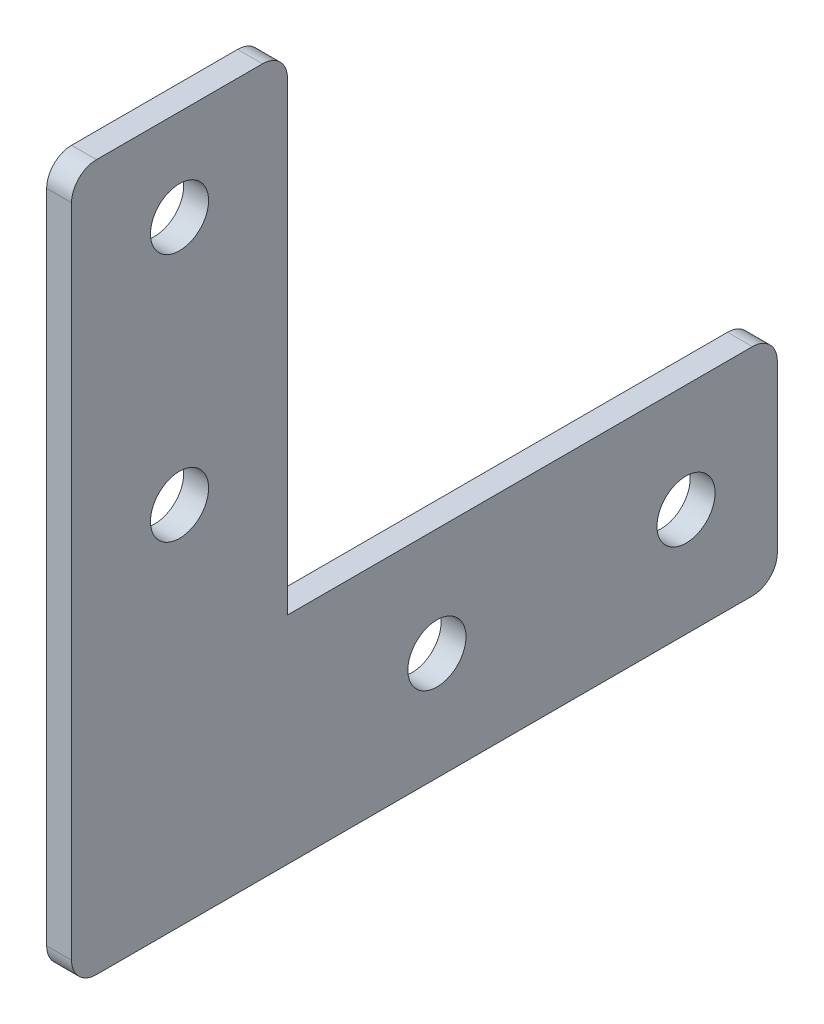
ISO-10303-21;
HEADER;
FILE_DESCRIPTION(('STEP AP214'),'2;1');
FILE_NAME('part.step','',(''),(''),'','','');
FILE_SCHEMA(('AUTOMOTIVE_DESIGN { 1 0 10303 214 1 1 1 1 }'));
ENDSEC;
DATA;
#1=APPLICATION_CONTEXT('core data for automotive mechanical design processes');
#2=APPLICATION_PROTOCOL_DEFINITION('international standard','automotive_design',2000,#1);
#3=PRODUCT_CONTEXT('',#1,'mechanical');
#4=PRODUCT('Part','Part','',(#3));
#5=PRODUCT_RELATED_PRODUCT_CATEGORY('part','',(#4));
#6=PRODUCT_DEFINITION_FORMATION('','',#4);
#7=PRODUCT_DEFINITION_CONTEXT('part definition',#1,'design');
#8=PRODUCT_DEFINITION('design','',#6,#7);
#9=PRODUCT_DEFINITION_SHAPE('','',#8);
#10=(LENGTH_UNIT() NAMED_UNIT(*) SI_UNIT(.MILLI.,.METRE.));
#11=(NAMED_UNIT(*) PLANE_ANGLE_UNIT() SI_UNIT($,.RADIAN.));
#12=(NAMED_UNIT(*) SI_UNIT($,.STERADIAN.) SOLID_ANGLE_UNIT());
#13=UNCERTAINTY_MEASURE_WITH_UNIT(LENGTH_MEASURE(1.E-05),#10,'distance_accuracy_value','');
#14=(GEOMETRIC_REPRESENTATION_CONTEXT(3) GLOBAL_UNCERTAINTY_ASSIGNED_CONTEXT((#13)) GLOBAL_UNIT_ASSIGNED_CONTEXT((#10,
#11,#12)) REPRESENTATION_CONTEXT('',''));
#15=CARTESIAN_POINT('',(0.,0.,0.));
#16=DIRECTION('',(0.,0.,1.));
#17=DIRECTION('',(1.,0.,0.));
#18=AXIS2_PLACEMENT_3D('',#15,#16,#17);
#19=CARTESIAN_POINT('',(3.,0.,-85.));
#20=DIRECTION('',(0.,0.,1.));
#21=DIRECTION('',(0.,-1.,0.));
#22=AXIS2_PLACEMENT_3D('',#19,#20,#21);
#23=PLANE('',#22);
#24=DIRECTION('',(0.,1.,0.));
#25=VECTOR('',#24,1.);
#26=CARTESIAN_POINT('',(0.,0.,-85.));
#27=LINE('',#26,#25);
#28=CARTESIAN_POINT('',(0.,3.,-85.));
#29=VERTEX_POINT('',#28);
#30=CARTESIAN_POINT('',(0.,23.,-85.));
#31=VERTEX_POINT('',#30);
#32=EDGE_CURVE('E136',#29,#31,#27,.T.);
#33=ORIENTED_EDGE('',*,*,#32,.T.);
#34=DIRECTION('',(-1.,0.,0.));
#35=VECTOR('',#34,1.);
#36=CARTESIAN_POINT('',(3.,23.,-85.));
#37=LINE('',#36,#35);
#38=CARTESIAN_POINT('',(3.,23.,-85.));
#39=VERTEX_POINT('',#38);
#40=EDGE_CURVE('E183',#31,#39,#37,.F.);
#41=ORIENTED_EDGE('',*,*,#40,.T.);
#42=DIRECTION('',(0.,1.,0.));
#43=VECTOR('',#42,1.);
#44=CARTESIAN_POINT('',(3.,0.,-85.));
#45=LINE('',#44,#43);
#46=CARTESIAN_POINT('',(3.,3.,-85.));
#47=VERTEX_POINT('',#46);
#48=EDGE_CURVE('E149',#47,#39,#45,.T.);
#49=ORIENTED_EDGE('',*,*,#48,.F.);
#50=DIRECTION('',(-1.,0.,0.));
#51=VECTOR('',#50,1.);
#52=CARTESIAN_POINT('',(3.,3.,-85.));
#53=LINE('',#52,#51);
#54=EDGE_CURVE('E180',#47,#29,#53,.T.);
#55=ORIENTED_EDGE('',*,*,#54,.T.);
#56=EDGE_LOOP('',(#33,#41,#49,#55));
#57=FACE_BOUND('',#56,.T.);
#58=ADVANCED_FACE('F34',(#57),#23,.F.);
#59=CARTESIAN_POINT('',(3.,85.,0.));
#60=DIRECTION('',(0.,-1.,0.));
#61=DIRECTION('',(0.,0.,-1.));
#62=AXIS2_PLACEMENT_3D('',#59,#60,#61);
#63=PLANE('',#62);
#64=DIRECTION('',(0.,0.,1.));
#65=VECTOR('',#64,1.);
#66=CARTESIAN_POINT('',(3.,85.,0.));
#67=LINE('',#66,#65);
#68=CARTESIAN_POINT('',(3.,85.,-23.));
#69=VERTEX_POINT('',#68);
#70=CARTESIAN_POINT('',(3.,85.,-3.));
#71=VERTEX_POINT('',#70);
#72=EDGE_CURVE('E151',#69,#71,#67,.T.);
#73=ORIENTED_EDGE('',*,*,#72,.F.);
#74=DIRECTION('',(-1.,0.,0.));
#75=VECTOR('',#74,1.);
#76=CARTESIAN_POINT('',(0.,85.,-23.));
#77=LINE('',#76,#75);
#78=CARTESIAN_POINT('',(0.,85.,-23.));
#79=VERTEX_POINT('',#78);
#80=EDGE_CURVE('E42',#69,#79,#77,.T.);
#81=ORIENTED_EDGE('',*,*,#80,.T.);
#82=DIRECTION('',(0.,0.,1.));
#83=VECTOR('',#82,1.);
#84=CARTESIAN_POINT('',(0.,85.,0.));
#85=LINE('',#84,#83);
#86=CARTESIAN_POINT('',(0.,85.,-3.));
#87=VERTEX_POINT('',#86);
#88=EDGE_CURVE('E162',#79,#87,#85,.T.);
#89=ORIENTED_EDGE('',*,*,#88,.T.);
#90=DIRECTION('',(-1.,0.,0.));
#91=VECTOR('',#90,1.);
#92=CARTESIAN_POINT('',(3.,85.,-3.));
#93=LINE('',#92,#91);
#94=EDGE_CURVE('E202',#87,#71,#93,.F.);
#95=ORIENTED_EDGE('',*,*,#94,.T.);
#96=EDGE_LOOP('',(#73,#81,#89,#95));
#97=FACE_BOUND('',#96,.T.);
#98=ADVANCED_FACE('F208',(#97),#63,.F.);
#99=CARTESIAN_POINT('',(3.,0.,0.));
#100=DIRECTION('',(-1.,0.,0.));
#101=DIRECTION('',(0.,0.,1.));
#102=AXIS2_PLACEMENT_3D('',#99,#100,#101);
#103=PLANE('',#102);
#104=CARTESIAN_POINT('',(3.,74.,-13.));
#105=DIRECTION('',(1.,0.,0.));
#106=DIRECTION('',(0.,0.,-1.));
#107=AXIS2_PLACEMENT_3D('',#104,#105,#106);
#108=CIRCLE('',#107,3.5);
#109=CARTESIAN_POINT('',(3.,74.,-16.5));
#110=VERTEX_POINT('',#109);
#111=EDGE_CURVE('E408',#110,#110,#108,.T.);
#112=ORIENTED_EDGE('',*,*,#111,.F.);
#113=EDGE_LOOP('',(#112));
#114=FACE_BOUND('',#113,.T.);
#115=CARTESIAN_POINT('',(3.,44.,-13.));
#116=DIRECTION('',(1.,0.,0.));
#117=DIRECTION('',(0.,0.,-1.));
#118=AXIS2_PLACEMENT_3D('',#115,#116,#117);
#119=CIRCLE('',#118,3.5);
#120=CARTESIAN_POINT('',(3.,44.,-16.5));
#121=VERTEX_POINT('',#120);
#122=EDGE_CURVE('E404',#121,#121,#119,.T.);
#123=ORIENTED_EDGE('',*,*,#122,.F.);
#124=EDGE_LOOP('',(#123));
#125=FACE_BOUND('',#124,.T.);
#126=CARTESIAN_POINT('',(3.,13.,-74.));
#127=DIRECTION('',(1.,0.,0.));
#128=DIRECTION('',(0.,0.,-1.));
#129=AXIS2_PLACEMENT_3D('',#126,#127,#128);
#130=CIRCLE('',#129,3.5);
#131=CARTESIAN_POINT('',(3.,13.,-77.5));
#132=VERTEX_POINT('',#131);
#133=EDGE_CURVE('E400',#132,#132,#130,.T.);
#134=ORIENTED_EDGE('',*,*,#133,.F.);
#135=EDGE_LOOP('',(#134));
#136=FACE_BOUND('',#135,.T.);
#137=CARTESIAN_POINT('',(3.,13.,-44.));
#138=DIRECTION('',(1.,0.,0.));
#139=DIRECTION('',(0.,0.,-1.));
#140=AXIS2_PLACEMENT_3D('',#137,#138,#139);
#141=CIRCLE('',#140,3.5);
#142=CARTESIAN_POINT('',(3.,13.,-47.5));
#143=VERTEX_POINT('',#142);
#144=EDGE_CURVE('E395',#143,#143,#141,.T.);
#145=ORIENTED_EDGE('',*,*,#144,.F.);
#146=EDGE_LOOP('',(#145));
#147=FACE_BOUND('',#146,.T.);
#148=ORIENTED_EDGE('',*,*,#48,.T.);
#149=CARTESIAN_POINT('',(3.,23.,-82.));
#150=DIRECTION('',(-1.,0.,0.));
#151=DIRECTION('',(0.,0.,1.));
#152=AXIS2_PLACEMENT_3D('',#149,#150,#151);
#153=CIRCLE('',#152,3.);
#154=CARTESIAN_POINT('',(3.,26.,-82.));
#155=VERTEX_POINT('',#154);
#156=EDGE_CURVE('E141',#39,#155,#153,.F.);
#157=ORIENTED_EDGE('',*,*,#156,.T.);
#158=DIRECTION('',(0.,0.,-1.));
#159=VECTOR('',#158,1.);
#160=CARTESIAN_POINT('',(3.,26.,-26.));
#161=LINE('',#160,#159);
#162=CARTESIAN_POINT('',(3.,26.,-26.));
#163=VERTEX_POINT('',#162);
#164=EDGE_CURVE('E127',#163,#155,#161,.T.);
#165=ORIENTED_EDGE('',*,*,#164,.F.);
#166=DIRECTION('',(0.,-1.,0.));
#167=VECTOR('',#166,1.);
#168=CARTESIAN_POINT('',(3.,85.,-26.));
#169=LINE('',#168,#167);
#170=CARTESIAN_POINT('',(3.,82.,-26.));
#171=VERTEX_POINT('',#170);
#172=EDGE_CURVE('E118',#171,#163,#169,.T.);
#173=ORIENTED_EDGE('',*,*,#172,.F.);
#174=CARTESIAN_POINT('',(3.,82.,-23.));
#175=DIRECTION('',(-1.,0.,0.));
#176=DIRECTION('',(0.,0.,1.));
#177=AXIS2_PLACEMENT_3D('',#174,#175,#176);
#178=CIRCLE('',#177,3.);
#179=EDGE_CURVE('E187',#171,#69,#178,.F.);
#180=ORIENTED_EDGE('',*,*,#179,.T.);
#181=ORIENTED_EDGE('',*,*,#72,.T.);
#182=CARTESIAN_POINT('',(3.,82.,-3.));
#183=DIRECTION('',(-1.,0.,0.));
#184=DIRECTION('',(0.,0.,1.));
#185=AXIS2_PLACEMENT_3D('',#182,#183,#184);
#186=CIRCLE('',#185,3.);
#187=CARTESIAN_POINT('',(3.,82.,0.));
#188=VERTEX_POINT('',#187);
#189=EDGE_CURVE('E185',#71,#188,#186,.F.);
#190=ORIENTED_EDGE('',*,*,#189,.T.);
#191=DIRECTION('',(0.,-1.,0.));
#192=VECTOR('',#191,1.);
#193=CARTESIAN_POINT('',(3.,0.,0.));
#194=LINE('',#193,#192);
#195=CARTESIAN_POINT('',(3.,3.,0.));
#196=VERTEX_POINT('',#195);
#197=EDGE_CURVE('E155',#188,#196,#194,.T.);
#198=ORIENTED_EDGE('',*,*,#197,.T.);
#199=CARTESIAN_POINT('',(3.,3.,-3.));
#200=DIRECTION('',(-1.,0.,0.));
#201=DIRECTION('',(0.,0.,1.));
#202=AXIS2_PLACEMENT_3D('',#199,#200,#201);
#203=CIRCLE('',#202,3.);
#204=CARTESIAN_POINT('',(3.,0.,-3.));
#205=VERTEX_POINT('',#204);
#206=EDGE_CURVE('E56',#196,#205,#203,.F.);
#207=ORIENTED_EDGE('',*,*,#206,.T.);
#208=DIRECTION('',(0.,0.,-1.));
#209=VECTOR('',#208,1.);
#210=CARTESIAN_POINT('',(3.,0.,0.));
#211=LINE('',#210,#209);
#212=CARTESIAN_POINT('',(3.,0.,-82.));
#213=VERTEX_POINT('',#212);
#214=EDGE_CURVE('E157',#205,#213,#211,.T.);
#215=ORIENTED_EDGE('',*,*,#214,.T.);
#216=CARTESIAN_POINT('',(3.,3.,-82.));
#217=DIRECTION('',(-1.,0.,0.));
#218=DIRECTION('',(0.,0.,1.));
#219=AXIS2_PLACEMENT_3D('',#216,#217,#218);
#220=CIRCLE('',#219,3.);
#221=EDGE_CURVE('E190',#213,#47,#220,.F.);
#222=ORIENTED_EDGE('',*,*,#221,.T.);
#223=EDGE_LOOP('',(#148,#157,#165,#173,#180,#181,#190,#198,#207,#215,#222));
#224=FACE_BOUND('',#223,.T.);
#225=ADVANCED_FACE('F139',(#114,#125,#136,#147,#224),#103,.F.);
#226=CARTESIAN_POINT('',(0.,0.,0.));
#227=DIRECTION('',(-1.,0.,0.));
#228=DIRECTION('',(0.,0.,1.));
#229=AXIS2_PLACEMENT_3D('',#226,#227,#228);
#230=PLANE('',#229);
#231=CARTESIAN_POINT('',(0.,74.,-13.));
#232=DIRECTION('',(1.,0.,0.));
#233=DIRECTION('',(0.,0.,-1.));
#234=AXIS2_PLACEMENT_3D('',#231,#232,#233);
#235=CIRCLE('',#234,3.5);
#236=CARTESIAN_POINT('',(0.,74.,-16.5));
#237=VERTEX_POINT('',#236);
#238=EDGE_CURVE('E384',#237,#237,#235,.T.);
#239=ORIENTED_EDGE('',*,*,#238,.T.);
#240=EDGE_LOOP('',(#239));
#241=FACE_BOUND('',#240,.T.);
#242=CARTESIAN_POINT('',(0.,44.,-13.));
#243=DIRECTION('',(1.,0.,0.));
#244=DIRECTION('',(0.,0.,-1.));
#245=AXIS2_PLACEMENT_3D('',#242,#243,#244);
#246=CIRCLE('',#245,3.5);
#247=CARTESIAN_POINT('',(0.,44.,-16.5));
#248=VERTEX_POINT('',#247);
#249=EDGE_CURVE('E388',#248,#248,#246,.T.);
#250=ORIENTED_EDGE('',*,*,#249,.T.);
#251=EDGE_LOOP('',(#250));
#252=FACE_BOUND('',#251,.T.);
#253=CARTESIAN_POINT('',(0.,13.,-74.));
#254=DIRECTION('',(1.,0.,0.));
#255=DIRECTION('',(0.,0.,-1.));
#256=AXIS2_PLACEMENT_3D('',#253,#254,#255);
#257=CIRCLE('',#256,3.5);
#258=CARTESIAN_POINT('',(0.,13.,-77.5));
#259=VERTEX_POINT('',#258);
#260=EDGE_CURVE('E392',#259,#259,#257,.T.);
#261=ORIENTED_EDGE('',*,*,#260,.T.);
#262=EDGE_LOOP('',(#261));
#263=FACE_BOUND('',#262,.T.);
#264=CARTESIAN_POINT('',(0.,13.,-44.));
#265=DIRECTION('',(1.,0.,0.));
#266=DIRECTION('',(0.,0.,-1.));
#267=AXIS2_PLACEMENT_3D('',#264,#265,#266);
#268=CIRCLE('',#267,3.5);
#269=CARTESIAN_POINT('',(0.,13.,-47.5));
#270=VERTEX_POINT('',#269);
#271=EDGE_CURVE('E147',#270,#270,#268,.T.);
#272=ORIENTED_EDGE('',*,*,#271,.T.);
#273=EDGE_LOOP('',(#272));
#274=FACE_BOUND('',#273,.T.);
#275=DIRECTION('',(0.,0.,-1.));
#276=VECTOR('',#275,1.);
#277=CARTESIAN_POINT('',(0.,26.,-26.));
#278=LINE('',#277,#276);
#279=CARTESIAN_POINT('',(0.,26.,-26.));
#280=VERTEX_POINT('',#279);
#281=CARTESIAN_POINT('',(0.,26.,-82.));
#282=VERTEX_POINT('',#281);
#283=EDGE_CURVE('E128',#280,#282,#278,.T.);
#284=ORIENTED_EDGE('',*,*,#283,.T.);
#285=CARTESIAN_POINT('',(0.,23.,-82.));
#286=DIRECTION('',(-1.,0.,0.));
#287=DIRECTION('',(0.,0.,1.));
#288=AXIS2_PLACEMENT_3D('',#285,#286,#287);
#289=CIRCLE('',#288,3.);
#290=EDGE_CURVE('E178',#282,#31,#289,.T.);
#291=ORIENTED_EDGE('',*,*,#290,.T.);
#292=ORIENTED_EDGE('',*,*,#32,.F.);
#293=CARTESIAN_POINT('',(0.,3.,-82.));
#294=DIRECTION('',(-1.,0.,0.));
#295=DIRECTION('',(0.,0.,1.));
#296=AXIS2_PLACEMENT_3D('',#293,#294,#295);
#297=CIRCLE('',#296,3.);
#298=CARTESIAN_POINT('',(0.,0.,-82.));
#299=VERTEX_POINT('',#298);
#300=EDGE_CURVE('E176',#29,#299,#297,.T.);
#301=ORIENTED_EDGE('',*,*,#300,.T.);
#302=DIRECTION('',(0.,0.,-1.));
#303=VECTOR('',#302,1.);
#304=CARTESIAN_POINT('',(0.,0.,0.));
#305=LINE('',#304,#303);
#306=CARTESIAN_POINT('',(0.,0.,-3.));
#307=VERTEX_POINT('',#306);
#308=EDGE_CURVE('E152',#307,#299,#305,.T.);
#309=ORIENTED_EDGE('',*,*,#308,.F.);
#310=CARTESIAN_POINT('',(0.,3.,-3.));
#311=DIRECTION('',(-1.,0.,0.));
#312=DIRECTION('',(0.,0.,1.));
#313=AXIS2_PLACEMENT_3D('',#310,#311,#312);
#314=CIRCLE('',#313,3.);
#315=CARTESIAN_POINT('',(0.,3.,0.));
#316=VERTEX_POINT('',#315);
#317=EDGE_CURVE('E174',#307,#316,#314,.T.);
#318=ORIENTED_EDGE('',*,*,#317,.T.);
#319=DIRECTION('',(0.,-1.,0.));
#320=VECTOR('',#319,1.);
#321=CARTESIAN_POINT('',(0.,0.,0.));
#322=LINE('',#321,#320);
#323=CARTESIAN_POINT('',(0.,82.,0.));
#324=VERTEX_POINT('',#323);
#325=EDGE_CURVE('E165',#324,#316,#322,.T.);
#326=ORIENTED_EDGE('',*,*,#325,.F.);
#327=CARTESIAN_POINT('',(0.,82.,-3.));
#328=DIRECTION('',(-1.,0.,0.));
#329=DIRECTION('',(0.,0.,1.));
#330=AXIS2_PLACEMENT_3D('',#327,#328,#329);
#331=CIRCLE('',#330,3.);
#332=EDGE_CURVE('E170',#324,#87,#331,.T.);
#333=ORIENTED_EDGE('',*,*,#332,.T.);
#334=ORIENTED_EDGE('',*,*,#88,.F.);
#335=CARTESIAN_POINT('',(0.,82.,-23.));
#336=DIRECTION('',(-1.,0.,0.));
#337=DIRECTION('',(0.,0.,1.));
#338=AXIS2_PLACEMENT_3D('',#335,#336,#337);
#339=CIRCLE('',#338,3.);
#340=CARTESIAN_POINT('',(0.,82.,-26.));
#341=VERTEX_POINT('',#340);
#342=EDGE_CURVE('E172',#79,#341,#339,.T.);
#343=ORIENTED_EDGE('',*,*,#342,.T.);
#344=DIRECTION('',(0.,-1.,0.));
#345=VECTOR('',#344,1.);
#346=CARTESIAN_POINT('',(0.,85.,-26.));
#347=LINE('',#346,#345);
#348=EDGE_CURVE('E145',#341,#280,#347,.T.);
#349=ORIENTED_EDGE('',*,*,#348,.T.);
#350=EDGE_LOOP('',(#284,#291,#292,#301,#309,#318,#326,#333,#334,#343,#349));
#351=FACE_BOUND('',#350,.T.);
#352=ADVANCED_FACE('F212',(#241,#252,#263,#274,#351),#230,.T.);
#353=CARTESIAN_POINT('',(3.,0.,0.));
#354=DIRECTION('',(0.,0.,-1.));
#355=DIRECTION('',(-1.,0.,0.));
#356=AXIS2_PLACEMENT_3D('',#353,#354,#355);
#357=PLANE('',#356);
#358=ORIENTED_EDGE('',*,*,#325,.T.);
#359=DIRECTION('',(-1.,0.,0.));
#360=VECTOR('',#359,1.);
#361=CARTESIAN_POINT('',(3.,3.,0.));
#362=LINE('',#361,#360);
#363=EDGE_CURVE('E200',#316,#196,#362,.F.);
#364=ORIENTED_EDGE('',*,*,#363,.T.);
#365=ORIENTED_EDGE('',*,*,#197,.F.);
#366=DIRECTION('',(-1.,0.,0.));
#367=VECTOR('',#366,1.);
#368=CARTESIAN_POINT('',(3.,82.,0.));
#369=LINE('',#368,#367);
#370=EDGE_CURVE('E197',#188,#324,#369,.T.);
#371=ORIENTED_EDGE('',*,*,#370,.T.);
#372=EDGE_LOOP('',(#358,#364,#365,#371));
#373=FACE_BOUND('',#372,.T.);
#374=ADVANCED_FACE('F219',(#373),#357,.F.);
#375=CARTESIAN_POINT('',(3.,0.,0.));
#376=DIRECTION('',(0.,1.,0.));
#377=DIRECTION('',(0.,0.,1.));
#378=AXIS2_PLACEMENT_3D('',#375,#376,#377);
#379=PLANE('',#378);
#380=ORIENTED_EDGE('',*,*,#308,.T.);
#381=DIRECTION('',(-1.,0.,0.));
#382=VECTOR('',#381,1.);
#383=CARTESIAN_POINT('',(3.,0.,-82.));
#384=LINE('',#383,#382);
#385=EDGE_CURVE('E49',#299,#213,#384,.F.);
#386=ORIENTED_EDGE('',*,*,#385,.T.);
#387=ORIENTED_EDGE('',*,*,#214,.F.);
#388=DIRECTION('',(-1.,0.,0.));
#389=VECTOR('',#388,1.);
#390=CARTESIAN_POINT('',(3.,0.,-3.));
#391=LINE('',#390,#389);
#392=EDGE_CURVE('E193',#205,#307,#391,.T.);
#393=ORIENTED_EDGE('',*,*,#392,.T.);
#394=EDGE_LOOP('',(#380,#386,#387,#393));
#395=FACE_BOUND('',#394,.T.);
#396=ADVANCED_FACE('F225',(#395),#379,.F.);
#397=CARTESIAN_POINT('',(3.,85.,-26.));
#398=DIRECTION('',(0.,0.,-1.));
#399=DIRECTION('',(-1.,0.,0.));
#400=AXIS2_PLACEMENT_3D('',#397,#398,#399);
#401=PLANE('',#400);
#402=ORIENTED_EDGE('',*,*,#348,.F.);
#403=DIRECTION('',(-1.,0.,0.));
#404=VECTOR('',#403,1.);
#405=CARTESIAN_POINT('',(3.,82.,-26.));
#406=LINE('',#405,#404);
#407=EDGE_CURVE('E11',#341,#171,#406,.F.);
#408=ORIENTED_EDGE('',*,*,#407,.T.);
#409=ORIENTED_EDGE('',*,*,#172,.T.);
#410=DIRECTION('',(-1.,0.,0.));
#411=VECTOR('',#410,1.);
#412=CARTESIAN_POINT('',(3.,26.,-26.));
#413=LINE('',#412,#411);
#414=EDGE_CURVE('E122',#163,#280,#413,.T.);
#415=ORIENTED_EDGE('',*,*,#414,.T.);
#416=EDGE_LOOP('',(#402,#408,#409,#415));
#417=FACE_BOUND('',#416,.T.);
#418=ADVANCED_FACE('F121',(#417),#401,.T.);
#419=CARTESIAN_POINT('',(3.,26.,-26.));
#420=DIRECTION('',(0.,1.,0.));
#421=DIRECTION('',(0.,0.,1.));
#422=AXIS2_PLACEMENT_3D('',#419,#420,#421);
#423=PLANE('',#422);
#424=ORIENTED_EDGE('',*,*,#164,.T.);
#425=DIRECTION('',(-1.,0.,0.));
#426=VECTOR('',#425,1.);
#427=CARTESIAN_POINT('',(0.,26.,-82.));
#428=LINE('',#427,#426);
#429=EDGE_CURVE('E159',#155,#282,#428,.T.);
#430=ORIENTED_EDGE('',*,*,#429,.T.);
#431=ORIENTED_EDGE('',*,*,#283,.F.);
#432=ORIENTED_EDGE('',*,*,#414,.F.);
#433=EDGE_LOOP('',(#424,#430,#431,#432));
#434=FACE_BOUND('',#433,.T.);
#435=ADVANCED_FACE('F132',(#434),#423,.T.);
#436=CARTESIAN_POINT('',(3.,13.,-44.));
#437=DIRECTION('',(1.,0.,0.));
#438=DIRECTION('',(0.,0.,-1.));
#439=AXIS2_PLACEMENT_3D('',#436,#437,#438);
#440=CYLINDRICAL_SURFACE('',#439,3.5);
#441=ORIENTED_EDGE('',*,*,#271,.F.);
#442=EDGE_LOOP('',(#441));
#443=FACE_BOUND('',#442,.T.);
#444=ORIENTED_EDGE('',*,*,#144,.T.);
#445=EDGE_LOOP('',(#444));
#446=FACE_BOUND('',#445,.T.);
#447=ADVANCED_FACE('F308',(#443,#446),#440,.F.);
#448=CARTESIAN_POINT('',(3.,13.,-74.));
#449=DIRECTION('',(1.,0.,0.));
#450=DIRECTION('',(0.,0.,-1.));
#451=AXIS2_PLACEMENT_3D('',#448,#449,#450);
#452=CYLINDRICAL_SURFACE('',#451,3.5);
#453=ORIENTED_EDGE('',*,*,#260,.F.);
#454=EDGE_LOOP('',(#453));
#455=FACE_BOUND('',#454,.T.);
#456=ORIENTED_EDGE('',*,*,#133,.T.);
#457=EDGE_LOOP('',(#456));
#458=FACE_BOUND('',#457,.T.);
#459=ADVANCED_FACE('F299',(#455,#458),#452,.F.);
#460=CARTESIAN_POINT('',(3.,44.,-13.));
#461=DIRECTION('',(1.,0.,0.));
#462=DIRECTION('',(0.,0.,-1.));
#463=AXIS2_PLACEMENT_3D('',#460,#461,#462);
#464=CYLINDRICAL_SURFACE('',#463,3.5);
#465=ORIENTED_EDGE('',*,*,#249,.F.);
#466=EDGE_LOOP('',(#465));
#467=FACE_BOUND('',#466,.T.);
#468=ORIENTED_EDGE('',*,*,#122,.T.);
#469=EDGE_LOOP('',(#468));
#470=FACE_BOUND('',#469,.T.);
#471=ADVANCED_FACE('F290',(#467,#470),#464,.F.);
#472=CARTESIAN_POINT('',(3.,74.,-13.));
#473=DIRECTION('',(1.,0.,0.));
#474=DIRECTION('',(0.,0.,-1.));
#475=AXIS2_PLACEMENT_3D('',#472,#473,#474);
#476=CYLINDRICAL_SURFACE('',#475,3.5);
#477=ORIENTED_EDGE('',*,*,#238,.F.);
#478=EDGE_LOOP('',(#477));
#479=FACE_BOUND('',#478,.T.);
#480=ORIENTED_EDGE('',*,*,#111,.T.);
#481=EDGE_LOOP('',(#480));
#482=FACE_BOUND('',#481,.T.);
#483=ADVANCED_FACE('F253',(#479,#482),#476,.F.);
#484=CARTESIAN_POINT('',(3.,23.,-82.));
#485=DIRECTION('',(1.,0.,0.));
#486=DIRECTION('',(0.,0.,-1.));
#487=AXIS2_PLACEMENT_3D('',#484,#485,#486);
#488=CYLINDRICAL_SURFACE('',#487,3.);
#489=ORIENTED_EDGE('',*,*,#156,.F.);
#490=ORIENTED_EDGE('',*,*,#40,.F.);
#491=ORIENTED_EDGE('',*,*,#290,.F.);
#492=ORIENTED_EDGE('',*,*,#429,.F.);
#493=EDGE_LOOP('',(#489,#490,#491,#492));
#494=FACE_BOUND('',#493,.T.);
#495=ADVANCED_FACE('F235',(#494),#488,.T.);
#496=CARTESIAN_POINT('',(3.,3.,-82.));
#497=DIRECTION('',(-1.,0.,0.));
#498=DIRECTION('',(0.,0.,1.));
#499=AXIS2_PLACEMENT_3D('',#496,#497,#498);
#500=CYLINDRICAL_SURFACE('',#499,3.);
#501=ORIENTED_EDGE('',*,*,#221,.F.);
#502=ORIENTED_EDGE('',*,*,#385,.F.);
#503=ORIENTED_EDGE('',*,*,#300,.F.);
#504=ORIENTED_EDGE('',*,*,#54,.F.);
#505=EDGE_LOOP('',(#501,#502,#503,#504));
#506=FACE_BOUND('',#505,.T.);
#507=ADVANCED_FACE('F230',(#506),#500,.T.);
#508=CARTESIAN_POINT('',(3.,3.,-3.));
#509=DIRECTION('',(-1.,0.,0.));
#510=DIRECTION('',(0.,0.,1.));
#511=AXIS2_PLACEMENT_3D('',#508,#509,#510);
#512=CYLINDRICAL_SURFACE('',#511,3.);
#513=ORIENTED_EDGE('',*,*,#206,.F.);
#514=ORIENTED_EDGE('',*,*,#363,.F.);
#515=ORIENTED_EDGE('',*,*,#317,.F.);
#516=ORIENTED_EDGE('',*,*,#392,.F.);
#517=EDGE_LOOP('',(#513,#514,#515,#516));
#518=FACE_BOUND('',#517,.T.);
#519=ADVANCED_FACE('F223',(#518),#512,.T.);
#520=CARTESIAN_POINT('',(3.,82.,-23.));
#521=DIRECTION('',(1.,0.,0.));
#522=DIRECTION('',(0.,0.,-1.));
#523=AXIS2_PLACEMENT_3D('',#520,#521,#522);
#524=CYLINDRICAL_SURFACE('',#523,3.);
#525=ORIENTED_EDGE('',*,*,#179,.F.);
#526=ORIENTED_EDGE('',*,*,#407,.F.);
#527=ORIENTED_EDGE('',*,*,#342,.F.);
#528=ORIENTED_EDGE('',*,*,#80,.F.);
#529=EDGE_LOOP('',(#525,#526,#527,#528));
#530=FACE_BOUND('',#529,.T.);
#531=ADVANCED_FACE('F236',(#530),#524,.T.);
#532=CARTESIAN_POINT('',(3.,82.,-3.));
#533=DIRECTION('',(-1.,0.,0.));
#534=DIRECTION('',(0.,0.,1.));
#535=AXIS2_PLACEMENT_3D('',#532,#533,#534);
#536=CYLINDRICAL_SURFACE('',#535,3.);
#537=ORIENTED_EDGE('',*,*,#189,.F.);
#538=ORIENTED_EDGE('',*,*,#94,.F.);
#539=ORIENTED_EDGE('',*,*,#332,.F.);
#540=ORIENTED_EDGE('',*,*,#370,.F.);
#541=EDGE_LOOP('',(#537,#538,#539,#540));
#542=FACE_BOUND('',#541,.T.);
#543=ADVANCED_FACE('F36',(#542),#536,.T.);
#544=CLOSED_SHELL('',(#58,#98,#225,#352,#374,#396,#418,#435,#447,#459,#471,#483,#495,#507,#519,
#531,#543));
#545=MANIFOLD_SOLID_BREP('B2',#544);
#546=ADVANCED_BREP_SHAPE_REPRESENTATION('',(#18,#545),#14);
#547=SHAPE_DEFINITION_REPRESENTATION(#9,#546);
ENDSEC;
END-ISO-10303-21;
